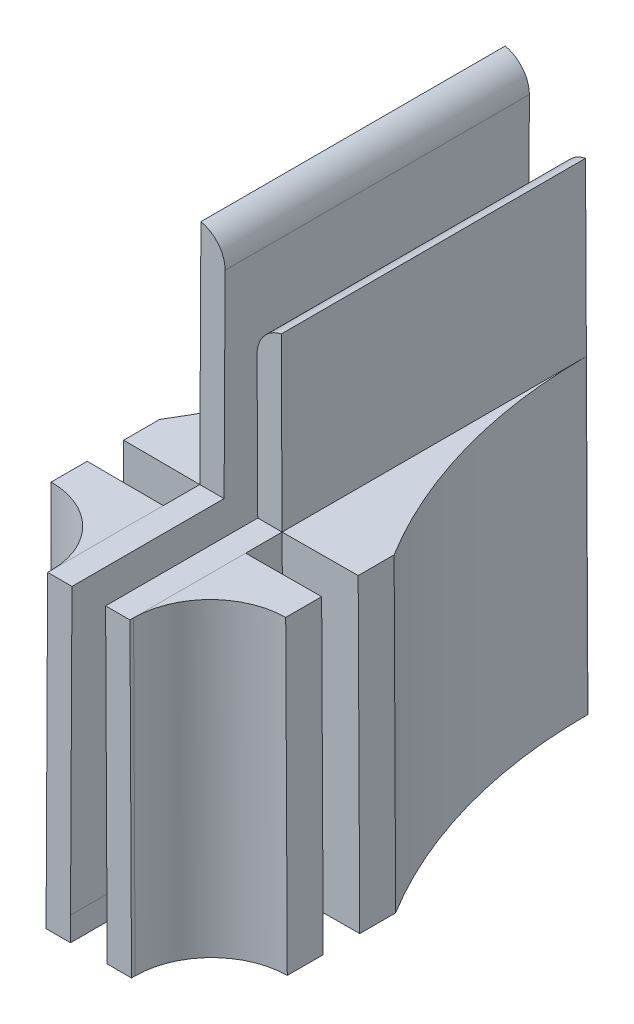
ISO-10303-21;
HEADER;
FILE_DESCRIPTION(('STEP AP214'),'2;1');
FILE_NAME('part.step','',(''),(''),'','','');
FILE_SCHEMA(('AUTOMOTIVE_DESIGN { 1 0 10303 214 1 1 1 1 }'));
ENDSEC;
DATA;
#1=APPLICATION_CONTEXT('core data for automotive mechanical design processes');
#2=APPLICATION_PROTOCOL_DEFINITION('international standard','automotive_design',2000,#1);
#3=PRODUCT_CONTEXT('',#1,'mechanical');
#4=PRODUCT('Part','Part','',(#3));
#5=PRODUCT_RELATED_PRODUCT_CATEGORY('part','',(#4));
#6=PRODUCT_DEFINITION_FORMATION('','',#4);
#7=PRODUCT_DEFINITION_CONTEXT('part definition',#1,'design');
#8=PRODUCT_DEFINITION('design','',#6,#7);
#9=PRODUCT_DEFINITION_SHAPE('','',#8);
#10=(LENGTH_UNIT() NAMED_UNIT(*) SI_UNIT(.MILLI.,.METRE.));
#11=(NAMED_UNIT(*) PLANE_ANGLE_UNIT() SI_UNIT($,.RADIAN.));
#12=(NAMED_UNIT(*) SI_UNIT($,.STERADIAN.) SOLID_ANGLE_UNIT());
#13=UNCERTAINTY_MEASURE_WITH_UNIT(LENGTH_MEASURE(1.E-05),#10,'distance_accuracy_value','');
#14=(GEOMETRIC_REPRESENTATION_CONTEXT(3) GLOBAL_UNCERTAINTY_ASSIGNED_CONTEXT((#13)) GLOBAL_UNIT_ASSIGNED_CONTEXT((#10,
#11,#12)) REPRESENTATION_CONTEXT('',''));
#15=CARTESIAN_POINT('',(0.,0.,0.));
#16=DIRECTION('',(0.,0.,1.));
#17=DIRECTION('',(1.,0.,0.));
#18=AXIS2_PLACEMENT_3D('',#15,#16,#17);
#19=CARTESIAN_POINT('',(-3.56593637484045,0.0178299047494033,38.1));
#20=DIRECTION('',(0.999987499921874,-0.00499999999999963,0.));
#21=DIRECTION('',(0.00499999999999963,0.999987499921874,0.));
#22=AXIS2_PLACEMENT_3D('',#19,#20,#21);
#23=PLANE('',#22);
#24=DIRECTION('',(0.,0.,-1.));
#25=VECTOR('',#24,1.);
#26=CARTESIAN_POINT('',(-3.56602552547859,0.,38.1));
#27=LINE('',#26,#25);
#28=CARTESIAN_POINT('',(-3.56602552547859,0.,0.039342585693096));
#29=VERTEX_POINT('',#28);
#30=CARTESIAN_POINT('',(-3.56602552547859,0.,0.));
#31=VERTEX_POINT('',#30);
#32=EDGE_CURVE('E517',#29,#31,#27,.T.);
#33=ORIENTED_EDGE('',*,*,#32,.F.);
#34=DIRECTION('',(0.00499999999999963,0.999987499921874,0.));
#35=VECTOR('',#34,1.);
#36=CARTESIAN_POINT('',(-3.56593637484045,0.0178299047494033,0.0393425856930821));
#37=LINE('',#36,#35);
#38=CARTESIAN_POINT('',(-3.43691329048857,25.8221242154014,0.0393425856930925));
#39=VERTEX_POINT('',#38);
#40=EDGE_CURVE('E242',#29,#39,#37,.T.);
#41=ORIENTED_EDGE('',*,*,#40,.T.);
#42=DIRECTION('',(0.,0.,-1.));
#43=VECTOR('',#42,1.);
#44=CARTESIAN_POINT('',(-3.43691329048857,25.8221242154014,22.4));
#45=LINE('',#44,#43);
#46=CARTESIAN_POINT('',(-3.43691329048857,25.8221242154014,25.4));
#47=VERTEX_POINT('',#46);
#48=EDGE_CURVE('E263',#47,#39,#45,.T.);
#49=ORIENTED_EDGE('',*,*,#48,.F.);
#50=DIRECTION('',(-0.00499999999999963,-0.999987499921874,0.));
#51=VECTOR('',#50,1.);
#52=CARTESIAN_POINT('',(-3.56593637484045,0.0178299047494033,25.4));
#53=LINE('',#52,#51);
#54=CARTESIAN_POINT('',(-3.3416620998412,44.8721242154013,25.4));
#55=VERTEX_POINT('',#54);
#56=EDGE_CURVE('E412',#55,#47,#53,.T.);
#57=ORIENTED_EDGE('',*,*,#56,.F.);
#58=DIRECTION('',(0.,0.,-1.));
#59=VECTOR('',#58,1.);
#60=CARTESIAN_POINT('',(-3.34166209984125,44.8721242154013,38.1));
#61=LINE('',#60,#59);
#62=CARTESIAN_POINT('',(-3.34166209984125,44.8721242154013,0.));
#63=VERTEX_POINT('',#62);
#64=EDGE_CURVE('E523',#55,#63,#61,.T.);
#65=ORIENTED_EDGE('',*,*,#64,.T.);
#66=DIRECTION('',(-0.00499999999999963,-0.999987499921874,0.));
#67=VECTOR('',#66,1.);
#68=CARTESIAN_POINT('',(-3.56593637484045,0.0178299047494033,0.));
#69=LINE('',#68,#67);
#70=EDGE_CURVE('E482',#63,#31,#69,.T.);
#71=ORIENTED_EDGE('',*,*,#70,.T.);
#72=EDGE_LOOP('',(#33,#41,#49,#57,#65,#71));
#73=FACE_BOUND('',#72,.T.);
#74=ADVANCED_FACE('F41',(#73),#23,.F.);
#75=DIRECTION('',(0.00499999999999963,0.999987499921874,0.));
#76=VECTOR('',#75,1.);
#77=CARTESIAN_POINT('',(-3.56602552547859,0.,25.4));
#78=LINE('',#77,#76);
#79=CARTESIAN_POINT('',(-3.56602552547859,0.,25.4));
#80=VERTEX_POINT('',#79);
#81=EDGE_CURVE('E266',#80,#47,#78,.T.);
#82=ORIENTED_EDGE('',*,*,#81,.F.);
#83=CARTESIAN_POINT('',(-3.56602552547859,0.,28.448));
#84=VERTEX_POINT('',#83);
#85=EDGE_CURVE('E524',#84,#80,#27,.T.);
#86=ORIENTED_EDGE('',*,*,#85,.F.);
#87=DIRECTION('',(-0.00499999999999963,-0.999987499921874,0.));
#88=VECTOR('',#87,1.);
#89=CARTESIAN_POINT('',(-3.56602552547859,0.,28.448));
#90=LINE('',#89,#88);
#91=CARTESIAN_POINT('',(-3.43691329048857,25.8221242154013,28.448));
#92=VERTEX_POINT('',#91);
#93=EDGE_CURVE('E302',#92,#84,#90,.T.);
#94=ORIENTED_EDGE('',*,*,#93,.F.);
#95=DIRECTION('',(0.,0.,1.));
#96=VECTOR('',#95,1.);
#97=CARTESIAN_POINT('',(-3.43691329048857,25.8221242154013,25.4));
#98=LINE('',#97,#96);
#99=EDGE_CURVE('E429',#47,#92,#98,.T.);
#100=ORIENTED_EDGE('',*,*,#99,.F.);
#101=EDGE_LOOP('',(#82,#86,#94,#100));
#102=FACE_BOUND('',#101,.T.);
#103=ADVANCED_FACE('F619',(#102),#23,.F.);
#104=CARTESIAN_POINT('',(-3.43691329048857,25.8221242154013,37.798));
#105=VERTEX_POINT('',#104);
#106=CARTESIAN_POINT('',(-3.43691329048857,25.8221242154013,38.1));
#107=VERTEX_POINT('',#106);
#108=EDGE_CURVE('E420',#105,#107,#98,.T.);
#109=ORIENTED_EDGE('',*,*,#108,.F.);
#110=DIRECTION('',(0.00499999999999963,0.999987499921874,0.));
#111=VECTOR('',#110,1.);
#112=CARTESIAN_POINT('',(-3.56602552547859,0.,37.798));
#113=LINE('',#112,#111);
#114=CARTESIAN_POINT('',(-3.56602552547859,0.,37.798));
#115=VERTEX_POINT('',#114);
#116=EDGE_CURVE('E563',#105,#115,#113,.F.);
#117=ORIENTED_EDGE('',*,*,#116,.T.);
#118=CARTESIAN_POINT('',(-3.56602552547859,0.,38.1));
#119=VERTEX_POINT('',#118);
#120=EDGE_CURVE('E519',#119,#115,#27,.T.);
#121=ORIENTED_EDGE('',*,*,#120,.F.);
#122=DIRECTION('',(-0.00499999999999963,-0.999987499921874,0.));
#123=VECTOR('',#122,1.);
#124=CARTESIAN_POINT('',(-3.56593637484045,0.0178299047494033,38.1));
#125=LINE('',#124,#123);
#126=EDGE_CURVE('E461',#107,#119,#125,.T.);
#127=ORIENTED_EDGE('',*,*,#126,.F.);
#128=EDGE_LOOP('',(#109,#117,#121,#127));
#129=FACE_BOUND('',#128,.T.);
#130=ADVANCED_FACE('F585',(#129),#23,.F.);
#131=CARTESIAN_POINT('',(3.56593637484045,0.0178299047494033,38.1));
#132=DIRECTION('',(-0.999987499921874,-0.00499999999999963,0.));
#133=DIRECTION('',(0.00499999999999963,-0.999987499921874,0.));
#134=AXIS2_PLACEMENT_3D('',#131,#132,#133);
#135=PLANE('',#134);
#136=DIRECTION('',(-0.00499999999999963,0.999987499921874,0.));
#137=VECTOR('',#136,1.);
#138=CARTESIAN_POINT('',(3.43691329048857,25.8221242154014,28.448));
#139=LINE('',#138,#137);
#140=CARTESIAN_POINT('',(3.56602552547859,0.,28.448));
#141=VERTEX_POINT('',#140);
#142=CARTESIAN_POINT('',(3.43691329048857,25.8221242154013,28.448));
#143=VERTEX_POINT('',#142);
#144=EDGE_CURVE('E316',#141,#143,#139,.T.);
#145=ORIENTED_EDGE('',*,*,#144,.F.);
#146=DIRECTION('',(0.,0.,-1.));
#147=VECTOR('',#146,1.);
#148=CARTESIAN_POINT('',(3.56602552547859,0.,38.1));
#149=LINE('',#148,#147);
#150=CARTESIAN_POINT('',(3.56602552547859,0.,25.4));
#151=VERTEX_POINT('',#150);
#152=EDGE_CURVE('E518',#141,#151,#149,.T.);
#153=ORIENTED_EDGE('',*,*,#152,.T.);
#154=DIRECTION('',(0.00499999999999963,-0.999987499921874,0.));
#155=VECTOR('',#154,1.);
#156=CARTESIAN_POINT('',(3.43691329048857,25.8221242154014,25.4));
#157=LINE('',#156,#155);
#158=CARTESIAN_POINT('',(3.43691329048857,25.8221242154013,25.4));
#159=VERTEX_POINT('',#158);
#160=EDGE_CURVE('E350',#159,#151,#157,.T.);
#161=ORIENTED_EDGE('',*,*,#160,.F.);
#162=DIRECTION('',(0.,0.,1.));
#163=VECTOR('',#162,1.);
#164=CARTESIAN_POINT('',(3.43691329048857,25.8221242154013,25.4));
#165=LINE('',#164,#163);
#166=EDGE_CURVE('E406',#159,#143,#165,.T.);
#167=ORIENTED_EDGE('',*,*,#166,.T.);
#168=EDGE_LOOP('',(#145,#153,#161,#167));
#169=FACE_BOUND('',#168,.T.);
#170=ADVANCED_FACE('F648',(#169),#135,.F.);
#171=CARTESIAN_POINT('',(3.56602552547859,0.,38.1));
#172=VERTEX_POINT('',#171);
#173=CARTESIAN_POINT('',(3.56602552547859,0.,37.798));
#174=VERTEX_POINT('',#173);
#175=EDGE_CURVE('E513',#172,#174,#149,.T.);
#176=ORIENTED_EDGE('',*,*,#175,.T.);
#177=DIRECTION('',(0.00499999999999963,-0.999987499921874,0.));
#178=VECTOR('',#177,1.);
#179=CARTESIAN_POINT('',(3.43691329048857,25.8221242154014,37.798));
#180=LINE('',#179,#178);
#181=CARTESIAN_POINT('',(3.43691329048857,25.8221242154014,37.798));
#182=VERTEX_POINT('',#181);
#183=EDGE_CURVE('E559',#174,#182,#180,.F.);
#184=ORIENTED_EDGE('',*,*,#183,.T.);
#185=CARTESIAN_POINT('',(3.43691329048857,25.8221242154013,38.1));
#186=VERTEX_POINT('',#185);
#187=EDGE_CURVE('E428',#182,#186,#165,.T.);
#188=ORIENTED_EDGE('',*,*,#187,.T.);
#189=DIRECTION('',(-0.00499999999999963,0.999987499921874,0.));
#190=VECTOR('',#189,1.);
#191=CARTESIAN_POINT('',(3.56593637484045,0.0178299047494033,38.1));
#192=LINE('',#191,#190);
#193=EDGE_CURVE('E470',#172,#186,#192,.T.);
#194=ORIENTED_EDGE('',*,*,#193,.F.);
#195=EDGE_LOOP('',(#176,#184,#188,#194));
#196=FACE_BOUND('',#195,.T.);
#197=ADVANCED_FACE('F654',(#196),#135,.F.);
#198=DIRECTION('',(0.,0.,1.));
#199=VECTOR('',#198,1.);
#200=CARTESIAN_POINT('',(3.43691329048857,25.8221242154014,25.4));
#201=LINE('',#200,#199);
#202=CARTESIAN_POINT('',(3.43691329048857,25.8221242154014,0.0393425856930821));
#203=VERTEX_POINT('',#202);
#204=EDGE_CURVE('E356',#203,#159,#201,.T.);
#205=ORIENTED_EDGE('',*,*,#204,.F.);
#206=DIRECTION('',(-0.00499999999999963,0.999987499921874,0.));
#207=VECTOR('',#206,1.);
#208=CARTESIAN_POINT('',(3.56593637484045,0.0178299047494033,0.0393425856930821));
#209=LINE('',#208,#207);
#210=CARTESIAN_POINT('',(3.56602552547859,0.,0.0393425856930821));
#211=VERTEX_POINT('',#210);
#212=EDGE_CURVE('E545',#203,#211,#209,.F.);
#213=ORIENTED_EDGE('',*,*,#212,.T.);
#214=CARTESIAN_POINT('',(3.56602552547859,0.,0.));
#215=VERTEX_POINT('',#214);
#216=EDGE_CURVE('E512',#211,#215,#149,.T.);
#217=ORIENTED_EDGE('',*,*,#216,.T.);
#218=DIRECTION('',(-0.00499999999999963,0.999987499921874,0.));
#219=VECTOR('',#218,1.);
#220=CARTESIAN_POINT('',(3.56593637484045,0.0178299047494033,0.));
#221=LINE('',#220,#219);
#222=CARTESIAN_POINT('',(3.36547459984125,40.1096837470234,0.));
#223=VERTEX_POINT('',#222);
#224=EDGE_CURVE('E490',#215,#223,#221,.T.);
#225=ORIENTED_EDGE('',*,*,#224,.T.);
#226=DIRECTION('',(0.,0.,-1.));
#227=VECTOR('',#226,1.);
#228=CARTESIAN_POINT('',(3.36547459984125,40.1096837470234,38.1));
#229=LINE('',#228,#227);
#230=CARTESIAN_POINT('',(3.36547459984125,40.1096837470234,25.4));
#231=VERTEX_POINT('',#230);
#232=EDGE_CURVE('E509',#231,#223,#229,.T.);
#233=ORIENTED_EDGE('',*,*,#232,.F.);
#234=DIRECTION('',(-0.00499999999999963,0.999987499921874,0.));
#235=VECTOR('',#234,1.);
#236=CARTESIAN_POINT('',(3.56593637484045,0.0178299047494033,25.4));
#237=LINE('',#236,#235);
#238=EDGE_CURVE('E445',#159,#231,#237,.T.);
#239=ORIENTED_EDGE('',*,*,#238,.F.);
#240=EDGE_LOOP('',(#205,#213,#217,#225,#233,#239));
#241=FACE_BOUND('',#240,.T.);
#242=ADVANCED_FACE('F657',(#241),#135,.F.);
#243=CARTESIAN_POINT('',(0.,2.,38.1));
#244=DIRECTION('',(0.,-1.,0.));
#245=DIRECTION('',(0.,0.,-1.));
#246=AXIS2_PLACEMENT_3D('',#243,#244,#245);
#247=PLANE('',#246);
#248=DIRECTION('',(-1.,0.,0.));
#249=VECTOR('',#248,1.);
#250=CARTESIAN_POINT('',(-1.524,2.,25.4));
#251=LINE('',#250,#249);
#252=CARTESIAN_POINT('',(1.524,2.,25.4));
#253=VERTEX_POINT('',#252);
#254=CARTESIAN_POINT('',(-1.524,2.,25.4));
#255=VERTEX_POINT('',#254);
#256=EDGE_CURVE('E398',#253,#255,#251,.T.);
#257=ORIENTED_EDGE('',*,*,#256,.F.);
#258=DIRECTION('',(0.,0.,-1.));
#259=VECTOR('',#258,1.);
#260=CARTESIAN_POINT('',(1.524,2.,38.1));
#261=LINE('',#260,#259);
#262=CARTESIAN_POINT('',(1.524,2.,0.));
#263=VERTEX_POINT('',#262);
#264=EDGE_CURVE('E505',#253,#263,#261,.T.);
#265=ORIENTED_EDGE('',*,*,#264,.T.);
#266=DIRECTION('',(-1.,0.,0.));
#267=VECTOR('',#266,1.);
#268=CARTESIAN_POINT('',(0.,2.,0.));
#269=LINE('',#268,#267);
#270=CARTESIAN_POINT('',(-1.524,2.,0.));
#271=VERTEX_POINT('',#270);
#272=EDGE_CURVE('E462',#263,#271,#269,.T.);
#273=ORIENTED_EDGE('',*,*,#272,.T.);
#274=DIRECTION('',(0.,0.,-1.));
#275=VECTOR('',#274,1.);
#276=CARTESIAN_POINT('',(-1.524,2.,38.1));
#277=LINE('',#276,#275);
#278=EDGE_CURVE('E478',#255,#271,#277,.T.);
#279=ORIENTED_EDGE('',*,*,#278,.F.);
#280=EDGE_LOOP('',(#257,#265,#273,#279));
#281=FACE_BOUND('',#280,.T.);
#282=ADVANCED_FACE('F664',(#281),#247,.F.);
#283=CARTESIAN_POINT('',(0.,0.,38.1));
#284=DIRECTION('',(0.,0.,1.));
#285=DIRECTION('',(1.,0.,0.));
#286=AXIS2_PLACEMENT_3D('',#283,#284,#285);
#287=PLANE('',#286);
#288=DIRECTION('',(0.,-1.,0.));
#289=VECTOR('',#288,1.);
#290=CARTESIAN_POINT('',(-1.524,2.,38.1));
#291=LINE('',#290,#289);
#292=CARTESIAN_POINT('',(-1.524,2.,38.1));
#293=VERTEX_POINT('',#292);
#294=CARTESIAN_POINT('',(-1.524,0.,38.1));
#295=VERTEX_POINT('',#294);
#296=EDGE_CURVE('E403',#293,#295,#291,.T.);
#297=ORIENTED_EDGE('',*,*,#296,.F.);
#298=DIRECTION('',(0.005,0.999987499921874,0.));
#299=VECTOR('',#298,1.);
#300=CARTESIAN_POINT('',(-1.53396177499922,0.00766990474940469,38.1));
#301=LINE('',#300,#299);
#302=CARTESIAN_POINT('',(-1.40488789001231,25.8221242154013,38.1));
#303=VERTEX_POINT('',#302);
#304=EDGE_CURVE('E457',#293,#303,#301,.T.);
#305=ORIENTED_EDGE('',*,*,#304,.T.);
#306=DIRECTION('',(1.,0.,0.));
#307=VECTOR('',#306,1.);
#308=CARTESIAN_POINT('',(3.43691329048857,25.8221242154013,38.1));
#309=LINE('',#308,#307);
#310=EDGE_CURVE('E422',#107,#303,#309,.T.);
#311=ORIENTED_EDGE('',*,*,#310,.F.);
#312=ORIENTED_EDGE('',*,*,#126,.T.);
#313=DIRECTION('',(1.,0.,0.));
#314=VECTOR('',#313,1.);
#315=CARTESIAN_POINT('',(0.,0.,38.1));
#316=LINE('',#315,#314);
#317=EDGE_CURVE('E466',#119,#295,#316,.T.);
#318=ORIENTED_EDGE('',*,*,#317,.T.);
#319=EDGE_LOOP('',(#297,#305,#311,#312,#318));
#320=FACE_BOUND('',#319,.T.);
#321=ADVANCED_FACE('F595',(#320),#287,.T.);
#322=CARTESIAN_POINT('',(3.8859116576949,37.6235732770699,38.1));
#323=DIRECTION('',(0.,0.,-1.));
#324=DIRECTION('',(-1.,0.,0.));
#325=AXIS2_PLACEMENT_3D('',#322,#323,#324);
#326=CYLINDRICAL_SURFACE('',#325,2.54);
#327=DIRECTION('',(0.,0.,-1.));
#328=VECTOR('',#327,1.);
#329=CARTESIAN_POINT('',(1.34594340789334,37.6108732770699,38.1));
#330=LINE('',#329,#328);
#331=CARTESIAN_POINT('',(1.34594340789334,37.6108732770699,25.4));
#332=VERTEX_POINT('',#331);
#333=CARTESIAN_POINT('',(1.34594340789334,37.6108732770699,0.));
#334=VERTEX_POINT('',#333);
#335=EDGE_CURVE('E527',#332,#334,#330,.T.);
#336=ORIENTED_EDGE('',*,*,#335,.F.);
#337=CARTESIAN_POINT('',(3.8859116576949,37.6235732770699,25.4));
#338=DIRECTION('',(0.,0.,1.));
#339=DIRECTION('',(1.,0.,0.));
#340=AXIS2_PLACEMENT_3D('',#337,#338,#339);
#341=CIRCLE('',#340,2.54);
#342=EDGE_CURVE('E438',#332,#231,#341,.F.);
#343=ORIENTED_EDGE('',*,*,#342,.T.);
#344=ORIENTED_EDGE('',*,*,#232,.T.);
#345=CARTESIAN_POINT('',(3.8859116576949,37.6235732770699,0.));
#346=DIRECTION('',(0.,0.,1.));
#347=DIRECTION('',(1.,0.,0.));
#348=AXIS2_PLACEMENT_3D('',#345,#346,#347);
#349=CIRCLE('',#348,2.54);
#350=EDGE_CURVE('E533',#334,#223,#349,.F.);
#351=ORIENTED_EDGE('',*,*,#350,.F.);
#352=EDGE_LOOP('',(#336,#343,#344,#351));
#353=FACE_BOUND('',#352,.T.);
#354=ADVANCED_FACE('F734',(#353),#326,.T.);
#355=CARTESIAN_POINT('',(-3.8620991576949,42.3860137454478,38.1));
#356=DIRECTION('',(0.,0.,-1.));
#357=DIRECTION('',(-1.,0.,0.));
#358=AXIS2_PLACEMENT_3D('',#355,#356,#357);
#359=CYLINDRICAL_SURFACE('',#358,2.54);
#360=ORIENTED_EDGE('',*,*,#64,.F.);
#361=CARTESIAN_POINT('',(-3.8620991576949,42.3860137454478,25.4));
#362=DIRECTION('',(0.,0.,1.));
#363=DIRECTION('',(1.,0.,0.));
#364=AXIS2_PLACEMENT_3D('',#361,#362,#363);
#365=CIRCLE('',#364,2.54);
#366=CARTESIAN_POINT('',(-1.32213090789334,42.3733137454478,25.4));
#367=VERTEX_POINT('',#366);
#368=EDGE_CURVE('E541',#55,#367,#365,.F.);
#369=ORIENTED_EDGE('',*,*,#368,.T.);
#370=DIRECTION('',(0.,0.,-1.));
#371=VECTOR('',#370,1.);
#372=CARTESIAN_POINT('',(-1.32213090789334,42.3733137454478,38.1));
#373=LINE('',#372,#371);
#374=CARTESIAN_POINT('',(-1.32213090789334,42.3733137454478,0.));
#375=VERTEX_POINT('',#374);
#376=EDGE_CURVE('E537',#375,#367,#373,.F.);
#377=ORIENTED_EDGE('',*,*,#376,.F.);
#378=CARTESIAN_POINT('',(-3.8620991576949,42.3860137454478,0.));
#379=DIRECTION('',(0.,0.,1.));
#380=DIRECTION('',(1.,0.,0.));
#381=AXIS2_PLACEMENT_3D('',#378,#379,#380);
#382=CIRCLE('',#381,2.54);
#383=EDGE_CURVE('E530',#63,#375,#382,.F.);
#384=ORIENTED_EDGE('',*,*,#383,.F.);
#385=EDGE_LOOP('',(#360,#369,#377,#384));
#386=FACE_BOUND('',#385,.T.);
#387=ADVANCED_FACE('F609',(#386),#359,.T.);
#388=CARTESIAN_POINT('',(-1.53396177499922,0.00766990474940469,38.1));
#389=DIRECTION('',(-0.999987499921874,0.005,0.));
#390=DIRECTION('',(-0.005,-0.999987499921874,0.));
#391=AXIS2_PLACEMENT_3D('',#388,#389,#390);
#392=PLANE('',#391);
#393=DIRECTION('',(0.005,0.999987499921874,0.));
#394=VECTOR('',#393,1.);
#395=CARTESIAN_POINT('',(-1.53396177499922,0.00766990474940469,25.4));
#396=LINE('',#395,#394);
#397=CARTESIAN_POINT('',(-1.40488789001231,25.8221242154013,25.4));
#398=VERTEX_POINT('',#397);
#399=EDGE_CURVE('E435',#398,#367,#396,.T.);
#400=ORIENTED_EDGE('',*,*,#399,.F.);
#401=DIRECTION('',(0.,0.,1.));
#402=VECTOR('',#401,1.);
#403=CARTESIAN_POINT('',(-1.40488789001231,25.8221242154013,38.1));
#404=LINE('',#403,#402);
#405=EDGE_CURVE('E452',#398,#303,#404,.T.);
#406=ORIENTED_EDGE('',*,*,#405,.T.);
#407=ORIENTED_EDGE('',*,*,#304,.F.);
#408=EDGE_CURVE('E501',#293,#255,#277,.T.);
#409=ORIENTED_EDGE('',*,*,#408,.T.);
#410=ORIENTED_EDGE('',*,*,#278,.T.);
#411=DIRECTION('',(0.005,0.999987499921874,0.));
#412=VECTOR('',#411,1.);
#413=CARTESIAN_POINT('',(-1.53396177499922,0.00766990474940469,0.));
#414=LINE('',#413,#412);
#415=EDGE_CURVE('E456',#271,#375,#414,.T.);
#416=ORIENTED_EDGE('',*,*,#415,.T.);
#417=ORIENTED_EDGE('',*,*,#376,.T.);
#418=EDGE_LOOP('',(#400,#406,#407,#409,#410,#416,#417));
#419=FACE_BOUND('',#418,.T.);
#420=ADVANCED_FACE('F602',(#419),#392,.F.);
#421=CARTESIAN_POINT('',(0.,0.,38.1));
#422=DIRECTION('',(0.,1.,0.));
#423=DIRECTION('',(-1.,0.,0.));
#424=AXIS2_PLACEMENT_3D('',#421,#422,#423);
#425=PLANE('',#424);
#426=DIRECTION('',(1.,0.,0.));
#427=VECTOR('',#426,1.);
#428=CARTESIAN_POINT('',(-1.524,0.,25.4));
#429=LINE('',#428,#427);
#430=CARTESIAN_POINT('',(-1.524,0.,25.4));
#431=VERTEX_POINT('',#430);
#432=CARTESIAN_POINT('',(1.524,0.,25.4));
#433=VERTEX_POINT('',#432);
#434=EDGE_CURVE('E389',#431,#433,#429,.T.);
#435=ORIENTED_EDGE('',*,*,#434,.F.);
#436=DIRECTION('',(0.,0.,1.));
#437=VECTOR('',#436,1.);
#438=CARTESIAN_POINT('',(-1.524,0.,25.4));
#439=LINE('',#438,#437);
#440=EDGE_CURVE('E402',#431,#295,#439,.T.);
#441=ORIENTED_EDGE('',*,*,#440,.T.);
#442=ORIENTED_EDGE('',*,*,#317,.F.);
#443=ORIENTED_EDGE('',*,*,#120,.T.);
#444=DIRECTION('',(0.,0.,1.));
#445=VECTOR('',#444,1.);
#446=CARTESIAN_POINT('',(-3.56602552547859,0.,31.448));
#447=LINE('',#446,#445);
#448=EDGE_CURVE('E289',#84,#115,#447,.T.);
#449=ORIENTED_EDGE('',*,*,#448,.F.);
#450=ORIENTED_EDGE('',*,*,#85,.T.);
#451=DIRECTION('',(0.,0.,1.));
#452=VECTOR('',#451,1.);
#453=CARTESIAN_POINT('',(-3.56602552547859,0.,22.4));
#454=LINE('',#453,#452);
#455=EDGE_CURVE('E274',#29,#80,#454,.T.);
#456=ORIENTED_EDGE('',*,*,#455,.F.);
#457=ORIENTED_EDGE('',*,*,#32,.T.);
#458=DIRECTION('',(1.,0.,0.));
#459=VECTOR('',#458,1.);
#460=CARTESIAN_POINT('',(0.,0.,0.));
#461=LINE('',#460,#459);
#462=EDGE_CURVE('E486',#31,#215,#461,.T.);
#463=ORIENTED_EDGE('',*,*,#462,.T.);
#464=ORIENTED_EDGE('',*,*,#216,.F.);
#465=DIRECTION('',(0.,0.,-1.));
#466=VECTOR('',#465,1.);
#467=CARTESIAN_POINT('',(3.56602552547859,0.,25.4));
#468=LINE('',#467,#466);
#469=EDGE_CURVE('E371',#151,#211,#468,.T.);
#470=ORIENTED_EDGE('',*,*,#469,.F.);
#471=ORIENTED_EDGE('',*,*,#152,.F.);
#472=DIRECTION('',(0.,0.,-1.));
#473=VECTOR('',#472,1.);
#474=CARTESIAN_POINT('',(3.56602552547859,0.,28.448));
#475=LINE('',#474,#473);
#476=EDGE_CURVE('E322',#174,#141,#475,.T.);
#477=ORIENTED_EDGE('',*,*,#476,.F.);
#478=ORIENTED_EDGE('',*,*,#175,.F.);
#479=CARTESIAN_POINT('',(1.524,0.,38.1));
#480=VERTEX_POINT('',#479);
#481=EDGE_CURVE('E465',#480,#172,#316,.T.);
#482=ORIENTED_EDGE('',*,*,#481,.F.);
#483=DIRECTION('',(0.,0.,1.));
#484=VECTOR('',#483,1.);
#485=CARTESIAN_POINT('',(1.524,0.,25.4));
#486=LINE('',#485,#484);
#487=EDGE_CURVE('E409',#433,#480,#486,.T.);
#488=ORIENTED_EDGE('',*,*,#487,.F.);
#489=EDGE_LOOP('',(#435,#441,#442,#443,#449,#450,#456,#457,#463,#464,#470,#471,#477,#478,#482,#488));
#490=FACE_BOUND('',#489,.T.);
#491=ADVANCED_FACE('F590',(#490),#425,.F.);
#492=CARTESIAN_POINT('',(1.53396177499922,0.00766990474940469,38.1));
#493=DIRECTION('',(0.999987499921874,0.005,0.));
#494=DIRECTION('',(-0.005,0.999987499921874,0.));
#495=AXIS2_PLACEMENT_3D('',#492,#493,#494);
#496=PLANE('',#495);
#497=DIRECTION('',(0.005,-0.999987499921874,0.));
#498=VECTOR('',#497,1.);
#499=CARTESIAN_POINT('',(1.53396177499922,0.00766990474940469,38.1));
#500=LINE('',#499,#498);
#501=CARTESIAN_POINT('',(1.40488789001231,25.8221242154013,38.1));
#502=VERTEX_POINT('',#501);
#503=CARTESIAN_POINT('',(1.524,2.,38.1));
#504=VERTEX_POINT('',#503);
#505=EDGE_CURVE('E474',#502,#504,#500,.T.);
#506=ORIENTED_EDGE('',*,*,#505,.F.);
#507=DIRECTION('',(0.,0.,-1.));
#508=VECTOR('',#507,1.);
#509=CARTESIAN_POINT('',(1.40488789001231,25.8221242154013,38.1));
#510=LINE('',#509,#508);
#511=CARTESIAN_POINT('',(1.40488789001231,25.8221242154013,25.4));
#512=VERTEX_POINT('',#511);
#513=EDGE_CURVE('E448',#502,#512,#510,.T.);
#514=ORIENTED_EDGE('',*,*,#513,.T.);
#515=DIRECTION('',(0.005,-0.999987499921874,0.));
#516=VECTOR('',#515,1.);
#517=CARTESIAN_POINT('',(1.53396177499922,0.00766990474940469,25.4));
#518=LINE('',#517,#516);
#519=EDGE_CURVE('E442',#332,#512,#518,.T.);
#520=ORIENTED_EDGE('',*,*,#519,.F.);
#521=ORIENTED_EDGE('',*,*,#335,.T.);
#522=DIRECTION('',(0.005,-0.999987499921874,0.));
#523=VECTOR('',#522,1.);
#524=CARTESIAN_POINT('',(1.53396177499922,0.00766990474940469,0.));
#525=LINE('',#524,#523);
#526=EDGE_CURVE('E494',#334,#263,#525,.T.);
#527=ORIENTED_EDGE('',*,*,#526,.T.);
#528=ORIENTED_EDGE('',*,*,#264,.F.);
#529=EDGE_CURVE('E506',#504,#253,#261,.T.);
#530=ORIENTED_EDGE('',*,*,#529,.F.);
#531=EDGE_LOOP('',(#506,#514,#520,#521,#527,#528,#530));
#532=FACE_BOUND('',#531,.T.);
#533=ADVANCED_FACE('F737',(#532),#496,.F.);
#534=DIRECTION('',(0.,1.,0.));
#535=VECTOR('',#534,1.);
#536=CARTESIAN_POINT('',(1.524,2.,38.1));
#537=LINE('',#536,#535);
#538=EDGE_CURVE('E390',#480,#504,#537,.T.);
#539=ORIENTED_EDGE('',*,*,#538,.F.);
#540=ORIENTED_EDGE('',*,*,#481,.T.);
#541=ORIENTED_EDGE('',*,*,#193,.T.);
#542=EDGE_CURVE('E384',#502,#186,#309,.T.);
#543=ORIENTED_EDGE('',*,*,#542,.F.);
#544=ORIENTED_EDGE('',*,*,#505,.T.);
#545=EDGE_LOOP('',(#539,#540,#541,#543,#544));
#546=FACE_BOUND('',#545,.T.);
#547=ADVANCED_FACE('F742',(#546),#287,.T.);
#548=CARTESIAN_POINT('',(0.,0.,0.));
#549=DIRECTION('',(0.,0.,1.));
#550=DIRECTION('',(1.,0.,0.));
#551=AXIS2_PLACEMENT_3D('',#548,#549,#550);
#552=PLANE('',#551);
#553=ORIENTED_EDGE('',*,*,#526,.F.);
#554=ORIENTED_EDGE('',*,*,#350,.T.);
#555=ORIENTED_EDGE('',*,*,#224,.F.);
#556=ORIENTED_EDGE('',*,*,#462,.F.);
#557=ORIENTED_EDGE('',*,*,#70,.F.);
#558=ORIENTED_EDGE('',*,*,#383,.T.);
#559=ORIENTED_EDGE('',*,*,#415,.F.);
#560=ORIENTED_EDGE('',*,*,#272,.F.);
#561=EDGE_LOOP('',(#553,#554,#555,#556,#557,#558,#559,#560));
#562=FACE_BOUND('',#561,.T.);
#563=ADVANCED_FACE('F729',(#562),#552,.F.);
#564=CARTESIAN_POINT('',(0.,0.,25.4));
#565=DIRECTION('',(0.,0.,1.));
#566=DIRECTION('',(1.,0.,0.));
#567=AXIS2_PLACEMENT_3D('',#564,#565,#566);
#568=PLANE('',#567);
#569=ORIENTED_EDGE('',*,*,#399,.T.);
#570=ORIENTED_EDGE('',*,*,#368,.F.);
#571=ORIENTED_EDGE('',*,*,#56,.T.);
#572=DIRECTION('',(1.,0.,0.));
#573=VECTOR('',#572,1.);
#574=CARTESIAN_POINT('',(3.43691329048857,25.8221242154013,25.4));
#575=LINE('',#574,#573);
#576=EDGE_CURVE('E416',#47,#398,#575,.T.);
#577=ORIENTED_EDGE('',*,*,#576,.T.);
#578=EDGE_LOOP('',(#569,#570,#571,#577));
#579=FACE_BOUND('',#578,.T.);
#580=ADVANCED_FACE('F605',(#579),#568,.T.);
#581=CARTESIAN_POINT('',(3.43691329048857,25.8221242154013,25.4));
#582=DIRECTION('',(0.,-1.,0.));
#583=DIRECTION('',(0.,0.,-1.));
#584=AXIS2_PLACEMENT_3D('',#581,#582,#583);
#585=PLANE('',#584);
#586=ORIENTED_EDGE('',*,*,#576,.F.);
#587=ORIENTED_EDGE('',*,*,#99,.T.);
#588=DIRECTION('',(0.,0.,-1.));
#589=VECTOR('',#588,1.);
#590=CARTESIAN_POINT('',(-3.43691329048857,25.8221242154014,31.448));
#591=LINE('',#590,#589);
#592=EDGE_CURVE('E58',#105,#92,#591,.T.);
#593=ORIENTED_EDGE('',*,*,#592,.F.);
#594=ORIENTED_EDGE('',*,*,#108,.T.);
#595=ORIENTED_EDGE('',*,*,#310,.T.);
#596=ORIENTED_EDGE('',*,*,#405,.F.);
#597=EDGE_LOOP('',(#586,#587,#593,#594,#595,#596));
#598=FACE_BOUND('',#597,.T.);
#599=ADVANCED_FACE('F599',(#598),#585,.F.);
#600=ORIENTED_EDGE('',*,*,#542,.T.);
#601=ORIENTED_EDGE('',*,*,#187,.F.);
#602=DIRECTION('',(0.,0.,1.));
#603=VECTOR('',#602,1.);
#604=CARTESIAN_POINT('',(3.43691329048857,25.8221242154014,28.448));
#605=LINE('',#604,#603);
#606=EDGE_CURVE('E337',#143,#182,#605,.T.);
#607=ORIENTED_EDGE('',*,*,#606,.F.);
#608=ORIENTED_EDGE('',*,*,#166,.F.);
#609=EDGE_CURVE('E421',#512,#159,#575,.T.);
#610=ORIENTED_EDGE('',*,*,#609,.F.);
#611=ORIENTED_EDGE('',*,*,#513,.F.);
#612=EDGE_LOOP('',(#600,#601,#607,#608,#610,#611));
#613=FACE_BOUND('',#612,.T.);
#614=ADVANCED_FACE('F703',(#613),#585,.F.);
#615=ORIENTED_EDGE('',*,*,#238,.T.);
#616=ORIENTED_EDGE('',*,*,#342,.F.);
#617=ORIENTED_EDGE('',*,*,#519,.T.);
#618=ORIENTED_EDGE('',*,*,#609,.T.);
#619=EDGE_LOOP('',(#615,#616,#617,#618));
#620=FACE_BOUND('',#619,.T.);
#621=ADVANCED_FACE('F698',(#620),#568,.T.);
#622=CARTESIAN_POINT('',(-1.524,2.,25.4));
#623=DIRECTION('',(-1.,0.,0.));
#624=DIRECTION('',(0.,0.,1.));
#625=AXIS2_PLACEMENT_3D('',#622,#623,#624);
#626=PLANE('',#625);
#627=ORIENTED_EDGE('',*,*,#296,.T.);
#628=ORIENTED_EDGE('',*,*,#440,.F.);
#629=DIRECTION('',(0.,-1.,0.));
#630=VECTOR('',#629,1.);
#631=CARTESIAN_POINT('',(-1.524,2.,25.4));
#632=LINE('',#631,#630);
#633=EDGE_CURVE('E385',#255,#431,#632,.T.);
#634=ORIENTED_EDGE('',*,*,#633,.F.);
#635=ORIENTED_EDGE('',*,*,#408,.F.);
#636=EDGE_LOOP('',(#627,#628,#634,#635));
#637=FACE_BOUND('',#636,.T.);
#638=ADVANCED_FACE('F754',(#637),#626,.F.);
#639=CARTESIAN_POINT('',(1.524,2.,25.4));
#640=DIRECTION('',(1.,0.,0.));
#641=DIRECTION('',(0.,1.,0.));
#642=AXIS2_PLACEMENT_3D('',#639,#640,#641);
#643=PLANE('',#642);
#644=ORIENTED_EDGE('',*,*,#538,.T.);
#645=ORIENTED_EDGE('',*,*,#529,.T.);
#646=DIRECTION('',(0.,1.,0.));
#647=VECTOR('',#646,1.);
#648=CARTESIAN_POINT('',(1.524,2.,25.4));
#649=LINE('',#648,#647);
#650=EDGE_CURVE('E394',#433,#253,#649,.T.);
#651=ORIENTED_EDGE('',*,*,#650,.F.);
#652=ORIENTED_EDGE('',*,*,#487,.T.);
#653=EDGE_LOOP('',(#644,#645,#651,#652));
#654=FACE_BOUND('',#653,.T.);
#655=ADVANCED_FACE('F759',(#654),#643,.F.);
#656=CARTESIAN_POINT('',(0.,0.,25.4));
#657=DIRECTION('',(0.,0.,1.));
#658=DIRECTION('',(1.,0.,0.));
#659=AXIS2_PLACEMENT_3D('',#656,#657,#658);
#660=PLANE('',#659);
#661=ORIENTED_EDGE('',*,*,#633,.T.);
#662=ORIENTED_EDGE('',*,*,#434,.T.);
#663=ORIENTED_EDGE('',*,*,#650,.T.);
#664=ORIENTED_EDGE('',*,*,#256,.T.);
#665=EDGE_LOOP('',(#661,#662,#663,#664));
#666=FACE_BOUND('',#665,.T.);
#667=ADVANCED_FACE('F756',(#666),#660,.T.);
#668=CARTESIAN_POINT('',(9.78683391499247,25.8538742154013,25.4));
#669=DIRECTION('',(0.,0.,-1.));
#670=DIRECTION('',(-1.,0.,0.));
#671=AXIS2_PLACEMENT_3D('',#668,#669,#670);
#672=PLANE('',#671);
#673=ORIENTED_EDGE('',*,*,#160,.T.);
#674=DIRECTION('',(-0.999987499921874,-0.00499999999999963,0.));
#675=VECTOR('',#674,1.);
#676=CARTESIAN_POINT('',(9.91594614998249,0.0317499999999981,25.4));
#677=LINE('',#676,#675);
#678=CARTESIAN_POINT('',(9.91594614998249,0.0317499999999981,25.4));
#679=VERTEX_POINT('',#678);
#680=EDGE_CURVE('E380',#679,#151,#677,.T.);
#681=ORIENTED_EDGE('',*,*,#680,.F.);
#682=DIRECTION('',(0.00499999999999963,-0.999987499921874,0.));
#683=VECTOR('',#682,1.);
#684=CARTESIAN_POINT('',(9.78683391499247,25.8538742154013,25.4));
#685=LINE('',#684,#683);
#686=CARTESIAN_POINT('',(9.78683391499247,25.8538742154013,25.4));
#687=VERTEX_POINT('',#686);
#688=EDGE_CURVE('E351',#687,#679,#685,.T.);
#689=ORIENTED_EDGE('',*,*,#688,.F.);
#690=DIRECTION('',(-0.999987499921874,-0.00499999999999963,0.));
#691=VECTOR('',#690,1.);
#692=CARTESIAN_POINT('',(9.78683391499247,25.8538742154013,25.4));
#693=LINE('',#692,#691);
#694=EDGE_CURVE('E367',#687,#159,#693,.T.);
#695=ORIENTED_EDGE('',*,*,#694,.T.);
#696=EDGE_LOOP('',(#673,#681,#689,#695));
#697=FACE_BOUND('',#696,.T.);
#698=ADVANCED_FACE('F692',(#697),#672,.F.);
#699=CARTESIAN_POINT('',(9.91594614998249,0.0317499999999981,25.4));
#700=DIRECTION('',(-0.00499999999999963,0.999987499921874,0.));
#701=DIRECTION('',(-0.999987499921874,-0.00499999999999963,0.));
#702=AXIS2_PLACEMENT_3D('',#699,#700,#701);
#703=PLANE('',#702);
#704=ORIENTED_EDGE('',*,*,#469,.T.);
#705=CARTESIAN_POINT('',(46.1104937096547,0.21272499999998,0.0393425856930821));
#706=DIRECTION('',(-0.00499999999999963,0.999987499921874,0.));
#707=DIRECTION('',(-0.999987499921874,-0.00499999999999963,0.));
#708=AXIS2_PLACEMENT_3D('',#705,#706,#707);
#709=CIRCLE('',#708,42.545);
#710=CARTESIAN_POINT('',(9.91594614998249,0.0317499999999981,22.4));
#711=VERTEX_POINT('',#710);
#712=EDGE_CURVE('E246',#211,#711,#709,.T.);
#713=ORIENTED_EDGE('',*,*,#712,.T.);
#714=DIRECTION('',(0.,0.,-1.));
#715=VECTOR('',#714,1.);
#716=CARTESIAN_POINT('',(9.91594614998249,0.0317499999999981,25.4));
#717=LINE('',#716,#715);
#718=EDGE_CURVE('E355',#679,#711,#717,.T.);
#719=ORIENTED_EDGE('',*,*,#718,.F.);
#720=ORIENTED_EDGE('',*,*,#680,.T.);
#721=EDGE_LOOP('',(#704,#713,#719,#720));
#722=FACE_BOUND('',#721,.T.);
#723=ADVANCED_FACE('F685',(#722),#703,.F.);
#724=CARTESIAN_POINT('',(9.78683391499247,25.8538742154013,25.4));
#725=DIRECTION('',(0.00499999999999963,-0.999987499921874,0.));
#726=DIRECTION('',(0.999987499921874,0.00499999999999963,0.));
#727=AXIS2_PLACEMENT_3D('',#724,#725,#726);
#728=PLANE('',#727);
#729=ORIENTED_EDGE('',*,*,#204,.T.);
#730=ORIENTED_EDGE('',*,*,#694,.F.);
#731=DIRECTION('',(0.,0.,1.));
#732=VECTOR('',#731,1.);
#733=CARTESIAN_POINT('',(9.78683391499247,25.8538742154013,25.4));
#734=LINE('',#733,#732);
#735=CARTESIAN_POINT('',(9.78683391499247,25.8538742154013,22.4));
#736=VERTEX_POINT('',#735);
#737=EDGE_CURVE('E364',#736,#687,#734,.T.);
#738=ORIENTED_EDGE('',*,*,#737,.F.);
#739=CARTESIAN_POINT('',(45.9813814746647,26.0348492154013,0.0393425856930821));
#740=DIRECTION('',(0.00499999999999963,-0.999987499921874,0.));
#741=DIRECTION('',(0.999987499921874,0.00499999999999963,0.));
#742=AXIS2_PLACEMENT_3D('',#739,#740,#741);
#743=CIRCLE('',#742,42.545);
#744=EDGE_CURVE('E551',#736,#203,#743,.T.);
#745=ORIENTED_EDGE('',*,*,#744,.T.);
#746=EDGE_LOOP('',(#729,#730,#738,#745));
#747=FACE_BOUND('',#746,.T.);
#748=ADVANCED_FACE('F679',(#747),#728,.F.);
#749=CARTESIAN_POINT('',(9.91585699934436,0.049579904749401,0.));
#750=DIRECTION('',(0.999987499921874,0.00499999999999963,0.));
#751=DIRECTION('',(-0.00499999999999963,0.999987499921874,0.));
#752=AXIS2_PLACEMENT_3D('',#749,#750,#751);
#753=PLANE('',#752);
#754=ORIENTED_EDGE('',*,*,#688,.T.);
#755=ORIENTED_EDGE('',*,*,#718,.T.);
#756=DIRECTION('',(-0.00499999999999963,0.999987499921874,0.));
#757=VECTOR('',#756,1.);
#758=CARTESIAN_POINT('',(9.78683391499247,25.8538742154013,22.4));
#759=LINE('',#758,#757);
#760=EDGE_CURVE('E360',#711,#736,#759,.T.);
#761=ORIENTED_EDGE('',*,*,#760,.T.);
#762=ORIENTED_EDGE('',*,*,#737,.T.);
#763=EDGE_LOOP('',(#754,#755,#761,#762));
#764=FACE_BOUND('',#763,.T.);
#765=ADVANCED_FACE('F688',(#764),#753,.T.);
#766=CARTESIAN_POINT('',(9.78683391499247,25.8538742154013,28.448));
#767=DIRECTION('',(0.,0.,1.));
#768=DIRECTION('',(1.,0.,0.));
#769=AXIS2_PLACEMENT_3D('',#766,#767,#768);
#770=PLANE('',#769);
#771=ORIENTED_EDGE('',*,*,#144,.T.);
#772=DIRECTION('',(-0.999987499921874,-0.00499999999999963,0.));
#773=VECTOR('',#772,1.);
#774=CARTESIAN_POINT('',(9.78683391499247,25.8538742154013,28.448));
#775=LINE('',#774,#773);
#776=CARTESIAN_POINT('',(9.78683391499247,25.8538742154013,28.448));
#777=VERTEX_POINT('',#776);
#778=EDGE_CURVE('E346',#777,#143,#775,.T.);
#779=ORIENTED_EDGE('',*,*,#778,.F.);
#780=DIRECTION('',(-0.00499999999999963,0.999987499921874,0.));
#781=VECTOR('',#780,1.);
#782=CARTESIAN_POINT('',(9.78683391499247,25.8538742154013,28.448));
#783=LINE('',#782,#781);
#784=CARTESIAN_POINT('',(9.91594614998249,0.0317499999999981,28.448));
#785=VERTEX_POINT('',#784);
#786=EDGE_CURVE('E317',#785,#777,#783,.T.);
#787=ORIENTED_EDGE('',*,*,#786,.F.);
#788=DIRECTION('',(-0.999987499921874,-0.00499999999999963,0.));
#789=VECTOR('',#788,1.);
#790=CARTESIAN_POINT('',(9.91594614998249,0.0317499999999981,28.448));
#791=LINE('',#790,#789);
#792=EDGE_CURVE('E333',#785,#141,#791,.T.);
#793=ORIENTED_EDGE('',*,*,#792,.T.);
#794=EDGE_LOOP('',(#771,#779,#787,#793));
#795=FACE_BOUND('',#794,.T.);
#796=ADVANCED_FACE('F723',(#795),#770,.F.);
#797=CARTESIAN_POINT('',(9.78683391499247,25.8538742154013,28.448));
#798=DIRECTION('',(0.00499999999999963,-0.999987499921874,0.));
#799=DIRECTION('',(0.999987499921874,0.00499999999999963,0.));
#800=AXIS2_PLACEMENT_3D('',#797,#798,#799);
#801=PLANE('',#800);
#802=ORIENTED_EDGE('',*,*,#606,.T.);
#803=CARTESIAN_POINT('',(9.78683391499247,25.8538742154013,37.798));
#804=DIRECTION('',(0.00499999999999963,-0.999987499921874,0.));
#805=DIRECTION('',(0.999987499921874,0.00499999999999963,0.));
#806=AXIS2_PLACEMENT_3D('',#803,#804,#805);
#807=CIRCLE('',#806,6.35);
#808=CARTESIAN_POINT('',(9.78683391499247,25.8538742154013,31.448));
#809=VERTEX_POINT('',#808);
#810=EDGE_CURVE('E571',#182,#809,#807,.T.);
#811=ORIENTED_EDGE('',*,*,#810,.T.);
#812=DIRECTION('',(0.,0.,1.));
#813=VECTOR('',#812,1.);
#814=CARTESIAN_POINT('',(9.78683391499247,25.8538742154013,28.448));
#815=LINE('',#814,#813);
#816=EDGE_CURVE('E321',#777,#809,#815,.T.);
#817=ORIENTED_EDGE('',*,*,#816,.F.);
#818=ORIENTED_EDGE('',*,*,#778,.T.);
#819=EDGE_LOOP('',(#802,#811,#817,#818));
#820=FACE_BOUND('',#819,.T.);
#821=ADVANCED_FACE('F707',(#820),#801,.F.);
#822=CARTESIAN_POINT('',(9.91594614998249,0.0317499999999981,28.448));
#823=DIRECTION('',(-0.00499999999999963,0.999987499921874,0.));
#824=DIRECTION('',(-0.999987499921874,-0.00499999999999963,0.));
#825=AXIS2_PLACEMENT_3D('',#822,#823,#824);
#826=PLANE('',#825);
#827=ORIENTED_EDGE('',*,*,#476,.T.);
#828=ORIENTED_EDGE('',*,*,#792,.F.);
#829=DIRECTION('',(0.,0.,-1.));
#830=VECTOR('',#829,1.);
#831=CARTESIAN_POINT('',(9.91594614998249,0.0317499999999981,28.448));
#832=LINE('',#831,#830);
#833=CARTESIAN_POINT('',(9.91594614998249,0.0317499999999981,31.448));
#834=VERTEX_POINT('',#833);
#835=EDGE_CURVE('E330',#834,#785,#832,.T.);
#836=ORIENTED_EDGE('',*,*,#835,.F.);
#837=CARTESIAN_POINT('',(9.91594614998249,0.0317499999999936,37.798));
#838=DIRECTION('',(-0.00499999999999963,0.999987499921874,0.));
#839=DIRECTION('',(-0.999987499921874,-0.00499999999999963,0.));
#840=AXIS2_PLACEMENT_3D('',#837,#838,#839);
#841=CIRCLE('',#840,6.35);
#842=EDGE_CURVE('E567',#834,#174,#841,.T.);
#843=ORIENTED_EDGE('',*,*,#842,.T.);
#844=EDGE_LOOP('',(#827,#828,#836,#843));
#845=FACE_BOUND('',#844,.T.);
#846=ADVANCED_FACE('F720',(#845),#826,.F.);
#847=CARTESIAN_POINT('',(9.91585699934436,0.049579904749401,0.));
#848=DIRECTION('',(-0.999987499921874,-0.00499999999999963,0.));
#849=DIRECTION('',(0.00499999999999963,-0.999987499921874,0.));
#850=AXIS2_PLACEMENT_3D('',#847,#848,#849);
#851=PLANE('',#850);
#852=ORIENTED_EDGE('',*,*,#786,.T.);
#853=ORIENTED_EDGE('',*,*,#816,.T.);
#854=DIRECTION('',(0.00499999999999963,-0.999987499921874,0.));
#855=VECTOR('',#854,1.);
#856=CARTESIAN_POINT('',(9.78683391499247,25.8538742154013,31.448));
#857=LINE('',#856,#855);
#858=EDGE_CURVE('E326',#809,#834,#857,.T.);
#859=ORIENTED_EDGE('',*,*,#858,.T.);
#860=ORIENTED_EDGE('',*,*,#835,.T.);
#861=EDGE_LOOP('',(#852,#853,#859,#860));
#862=FACE_BOUND('',#861,.T.);
#863=ADVANCED_FACE('F717',(#862),#851,.F.);
#864=CARTESIAN_POINT('',(-9.78683391499247,25.8538742154013,31.448));
#865=DIRECTION('',(-0.00499999999999963,-0.999987499921874,0.));
#866=DIRECTION('',(0.999987499921874,-0.00499999999999963,0.));
#867=AXIS2_PLACEMENT_3D('',#864,#865,#866);
#868=PLANE('',#867);
#869=ORIENTED_EDGE('',*,*,#592,.T.);
#870=DIRECTION('',(0.999987499921874,-0.00499999999999963,0.));
#871=VECTOR('',#870,1.);
#872=CARTESIAN_POINT('',(-9.78683391499247,25.8538742154013,28.448));
#873=LINE('',#872,#871);
#874=CARTESIAN_POINT('',(-9.78683391499247,25.8538742154013,28.448));
#875=VERTEX_POINT('',#874);
#876=EDGE_CURVE('E312',#875,#92,#873,.T.);
#877=ORIENTED_EDGE('',*,*,#876,.F.);
#878=DIRECTION('',(0.,0.,-1.));
#879=VECTOR('',#878,1.);
#880=CARTESIAN_POINT('',(-9.78683391499247,25.8538742154013,31.448));
#881=LINE('',#880,#879);
#882=CARTESIAN_POINT('',(-9.78683391499247,25.8538742154013,31.448));
#883=VERTEX_POINT('',#882);
#884=EDGE_CURVE('E288',#883,#875,#881,.T.);
#885=ORIENTED_EDGE('',*,*,#884,.F.);
#886=CARTESIAN_POINT('',(-9.78683391499247,25.8538742154014,37.798));
#887=DIRECTION('',(-0.00499999999999963,-0.999987499921874,0.));
#888=DIRECTION('',(0.999987499921874,-0.00499999999999963,0.));
#889=AXIS2_PLACEMENT_3D('',#886,#887,#888);
#890=CIRCLE('',#889,6.35);
#891=EDGE_CURVE('E51',#883,#105,#890,.T.);
#892=ORIENTED_EDGE('',*,*,#891,.T.);
#893=EDGE_LOOP('',(#869,#877,#885,#892));
#894=FACE_BOUND('',#893,.T.);
#895=ADVANCED_FACE('F578',(#894),#868,.F.);
#896=CARTESIAN_POINT('',(-9.91594614998249,0.0317499999999966,28.448));
#897=DIRECTION('',(0.,0.,1.));
#898=DIRECTION('',(1.,0.,0.));
#899=AXIS2_PLACEMENT_3D('',#896,#897,#898);
#900=PLANE('',#899);
#901=ORIENTED_EDGE('',*,*,#93,.T.);
#902=DIRECTION('',(0.999987499921874,-0.00499999999999963,0.));
#903=VECTOR('',#902,1.);
#904=CARTESIAN_POINT('',(-9.91594614998249,0.0317499999999966,28.448));
#905=LINE('',#904,#903);
#906=CARTESIAN_POINT('',(-9.91594614998249,0.0317499999999966,28.448));
#907=VERTEX_POINT('',#906);
#908=EDGE_CURVE('E299',#907,#84,#905,.T.);
#909=ORIENTED_EDGE('',*,*,#908,.F.);
#910=DIRECTION('',(-0.00499999999999963,-0.999987499921874,0.));
#911=VECTOR('',#910,1.);
#912=CARTESIAN_POINT('',(-9.91594614998249,0.0317499999999966,28.448));
#913=LINE('',#912,#911);
#914=EDGE_CURVE('E292',#875,#907,#913,.T.);
#915=ORIENTED_EDGE('',*,*,#914,.F.);
#916=ORIENTED_EDGE('',*,*,#876,.T.);
#917=EDGE_LOOP('',(#901,#909,#915,#916));
#918=FACE_BOUND('',#917,.T.);
#919=ADVANCED_FACE('F622',(#918),#900,.F.);
#920=CARTESIAN_POINT('',(-9.91594614998249,0.031749999999997,31.448));
#921=DIRECTION('',(0.00499999999999963,0.999987499921874,0.));
#922=DIRECTION('',(-0.999987499921874,0.00499999999999963,0.));
#923=AXIS2_PLACEMENT_3D('',#920,#921,#922);
#924=PLANE('',#923);
#925=ORIENTED_EDGE('',*,*,#448,.T.);
#926=CARTESIAN_POINT('',(-9.91594614998249,0.0317499999999978,37.798));
#927=DIRECTION('',(0.00499999999999963,0.999987499921874,0.));
#928=DIRECTION('',(-0.999987499921874,0.00499999999999963,0.));
#929=AXIS2_PLACEMENT_3D('',#926,#927,#928);
#930=CIRCLE('',#929,6.35);
#931=CARTESIAN_POINT('',(-9.91594614998249,0.031749999999997,31.448));
#932=VERTEX_POINT('',#931);
#933=EDGE_CURVE('E11',#115,#932,#930,.T.);
#934=ORIENTED_EDGE('',*,*,#933,.T.);
#935=DIRECTION('',(0.,0.,1.));
#936=VECTOR('',#935,1.);
#937=CARTESIAN_POINT('',(-9.91594614998249,0.031749999999997,31.448));
#938=LINE('',#937,#936);
#939=EDGE_CURVE('E295',#907,#932,#938,.T.);
#940=ORIENTED_EDGE('',*,*,#939,.F.);
#941=ORIENTED_EDGE('',*,*,#908,.T.);
#942=EDGE_LOOP('',(#925,#934,#940,#941));
#943=FACE_BOUND('',#942,.T.);
#944=ADVANCED_FACE('F626',(#943),#924,.F.);
#945=CARTESIAN_POINT('',(-9.91585699934436,0.049579904749401,0.));
#946=DIRECTION('',(-0.999987499921874,0.00499999999999963,0.));
#947=DIRECTION('',(-0.00499999999999963,-0.999987499921874,0.));
#948=AXIS2_PLACEMENT_3D('',#945,#946,#947);
#949=PLANE('',#948);
#950=DIRECTION('',(0.00499999999999963,0.999987499921874,0.));
#951=VECTOR('',#950,1.);
#952=CARTESIAN_POINT('',(-9.91594614998249,0.031749999999997,31.448));
#953=LINE('',#952,#951);
#954=EDGE_CURVE('E284',#932,#883,#953,.T.);
#955=ORIENTED_EDGE('',*,*,#954,.T.);
#956=ORIENTED_EDGE('',*,*,#884,.T.);
#957=ORIENTED_EDGE('',*,*,#914,.T.);
#958=ORIENTED_EDGE('',*,*,#939,.T.);
#959=EDGE_LOOP('',(#955,#956,#957,#958));
#960=FACE_BOUND('',#959,.T.);
#961=ADVANCED_FACE('F628',(#960),#949,.T.);
#962=CARTESIAN_POINT('',(-9.91594614998249,0.031749999999997,22.4));
#963=DIRECTION('',(0.00499999999999963,0.999987499921874,0.));
#964=DIRECTION('',(-0.999987499921874,0.00499999999999963,0.));
#965=AXIS2_PLACEMENT_3D('',#962,#963,#964);
#966=PLANE('',#965);
#967=ORIENTED_EDGE('',*,*,#455,.T.);
#968=DIRECTION('',(0.999987499921874,-0.00499999999999963,0.));
#969=VECTOR('',#968,1.);
#970=CARTESIAN_POINT('',(-9.91594614998249,0.031749999999997,25.4));
#971=LINE('',#970,#969);
#972=CARTESIAN_POINT('',(-9.91594614998249,0.031749999999997,25.4));
#973=VERTEX_POINT('',#972);
#974=EDGE_CURVE('E252',#973,#80,#971,.T.);
#975=ORIENTED_EDGE('',*,*,#974,.F.);
#976=DIRECTION('',(0.,0.,1.));
#977=VECTOR('',#976,1.);
#978=CARTESIAN_POINT('',(-9.91594614998249,0.031749999999997,22.4));
#979=LINE('',#978,#977);
#980=CARTESIAN_POINT('',(-9.91594614998249,0.031749999999997,22.4));
#981=VERTEX_POINT('',#980);
#982=EDGE_CURVE('E249',#981,#973,#979,.T.);
#983=ORIENTED_EDGE('',*,*,#982,.F.);
#984=CARTESIAN_POINT('',(-46.1104937096547,0.212724999999984,0.0393425856930855));
#985=DIRECTION('',(0.00499999999999963,0.999987499921874,0.));
#986=DIRECTION('',(-0.999987499921874,0.00499999999999963,0.));
#987=AXIS2_PLACEMENT_3D('',#984,#985,#986);
#988=CIRCLE('',#987,42.545);
#989=EDGE_CURVE('E235',#981,#29,#988,.T.);
#990=ORIENTED_EDGE('',*,*,#989,.T.);
#991=EDGE_LOOP('',(#967,#975,#983,#990));
#992=FACE_BOUND('',#991,.T.);
#993=ADVANCED_FACE('F250',(#992),#966,.F.);
#994=CARTESIAN_POINT('',(-9.91594614998249,0.031749999999997,25.4));
#995=DIRECTION('',(0.,0.,-1.));
#996=DIRECTION('',(-1.,0.,0.));
#997=AXIS2_PLACEMENT_3D('',#994,#995,#996);
#998=PLANE('',#997);
#999=ORIENTED_EDGE('',*,*,#81,.T.);
#1000=DIRECTION('',(0.999987499921874,-0.00499999999999963,0.));
#1001=VECTOR('',#1000,1.);
#1002=CARTESIAN_POINT('',(-9.78683391499247,25.8538742154013,25.4));
#1003=LINE('',#1002,#1001);
#1004=CARTESIAN_POINT('',(-9.78683391499247,25.8538742154013,25.4));
#1005=VERTEX_POINT('',#1004);
#1006=EDGE_CURVE('E273',#1005,#47,#1003,.T.);
#1007=ORIENTED_EDGE('',*,*,#1006,.F.);
#1008=DIRECTION('',(0.00499999999999963,0.999987499921874,0.));
#1009=VECTOR('',#1008,1.);
#1010=CARTESIAN_POINT('',(-9.91594614998249,0.031749999999997,25.4));
#1011=LINE('',#1010,#1009);
#1012=EDGE_CURVE('E256',#973,#1005,#1011,.T.);
#1013=ORIENTED_EDGE('',*,*,#1012,.F.);
#1014=ORIENTED_EDGE('',*,*,#974,.T.);
#1015=EDGE_LOOP('',(#999,#1007,#1013,#1014));
#1016=FACE_BOUND('',#1015,.T.);
#1017=ADVANCED_FACE('F635',(#1016),#998,.F.);
#1018=CARTESIAN_POINT('',(-9.78683391499247,25.8538742154013,22.4));
#1019=DIRECTION('',(-0.00499999999999963,-0.999987499921874,0.));
#1020=DIRECTION('',(0.999987499921874,-0.00499999999999963,0.));
#1021=AXIS2_PLACEMENT_3D('',#1018,#1019,#1020);
#1022=PLANE('',#1021);
#1023=ORIENTED_EDGE('',*,*,#48,.T.);
#1024=CARTESIAN_POINT('',(-45.9813814746647,26.0348492154013,0.0393425856930855));
#1025=DIRECTION('',(-0.00499999999999963,-0.999987499921874,0.));
#1026=DIRECTION('',(0.999987499921874,-0.00499999999999963,0.));
#1027=AXIS2_PLACEMENT_3D('',#1024,#1025,#1026);
#1028=CIRCLE('',#1027,42.545);
#1029=CARTESIAN_POINT('',(-9.78683391499247,25.8538742154013,22.4));
#1030=VERTEX_POINT('',#1029);
#1031=EDGE_CURVE('E245',#39,#1030,#1028,.T.);
#1032=ORIENTED_EDGE('',*,*,#1031,.T.);
#1033=DIRECTION('',(0.,0.,-1.));
#1034=VECTOR('',#1033,1.);
#1035=CARTESIAN_POINT('',(-9.78683391499247,25.8538742154013,22.4));
#1036=LINE('',#1035,#1034);
#1037=EDGE_CURVE('E261',#1005,#1030,#1036,.T.);
#1038=ORIENTED_EDGE('',*,*,#1037,.F.);
#1039=ORIENTED_EDGE('',*,*,#1006,.T.);
#1040=EDGE_LOOP('',(#1023,#1032,#1038,#1039));
#1041=FACE_BOUND('',#1040,.T.);
#1042=ADVANCED_FACE('F984',(#1041),#1022,.F.);
#1043=CARTESIAN_POINT('',(-9.91585699934436,0.049579904749401,0.));
#1044=DIRECTION('',(0.999987499921874,-0.00499999999999963,0.));
#1045=DIRECTION('',(0.00499999999999963,0.999987499921874,0.));
#1046=AXIS2_PLACEMENT_3D('',#1043,#1044,#1045);
#1047=PLANE('',#1046);
#1048=DIRECTION('',(-0.00499999999999963,-0.999987499921874,0.));
#1049=VECTOR('',#1048,1.);
#1050=CARTESIAN_POINT('',(-9.91594614998249,0.031749999999997,22.4));
#1051=LINE('',#1050,#1049);
#1052=EDGE_CURVE('E240',#1030,#981,#1051,.T.);
#1053=ORIENTED_EDGE('',*,*,#1052,.T.);
#1054=ORIENTED_EDGE('',*,*,#982,.T.);
#1055=ORIENTED_EDGE('',*,*,#1012,.T.);
#1056=ORIENTED_EDGE('',*,*,#1037,.T.);
#1057=EDGE_LOOP('',(#1053,#1054,#1055,#1056));
#1058=FACE_BOUND('',#1057,.T.);
#1059=ADVANCED_FACE('F259',(#1058),#1047,.F.);
#1060=CARTESIAN_POINT('',(45.9813814746647,26.0348492154013,0.0393425856930821));
#1061=DIRECTION('',(-0.00499999999999963,0.999987499921874,0.));
#1062=DIRECTION('',(-0.999987499921874,-0.00499999999999963,0.));
#1063=AXIS2_PLACEMENT_3D('',#1060,#1061,#1062);
#1064=CYLINDRICAL_SURFACE('',#1063,42.545);
#1065=ORIENTED_EDGE('',*,*,#712,.F.);
#1066=ORIENTED_EDGE('',*,*,#212,.F.);
#1067=ORIENTED_EDGE('',*,*,#744,.F.);
#1068=ORIENTED_EDGE('',*,*,#760,.F.);
#1069=EDGE_LOOP('',(#1065,#1066,#1067,#1068));
#1070=FACE_BOUND('',#1069,.T.);
#1071=ADVANCED_FACE('F683',(#1070),#1064,.F.);
#1072=CARTESIAN_POINT('',(-46.1104937096547,0.212724999999984,0.0393425856930855));
#1073=DIRECTION('',(0.00499999999999963,0.999987499921874,0.));
#1074=DIRECTION('',(-0.999987499921874,0.00499999999999963,0.));
#1075=AXIS2_PLACEMENT_3D('',#1072,#1073,#1074);
#1076=CYLINDRICAL_SURFACE('',#1075,42.545);
#1077=ORIENTED_EDGE('',*,*,#1031,.F.);
#1078=ORIENTED_EDGE('',*,*,#40,.F.);
#1079=ORIENTED_EDGE('',*,*,#989,.F.);
#1080=ORIENTED_EDGE('',*,*,#1052,.F.);
#1081=EDGE_LOOP('',(#1077,#1078,#1079,#1080));
#1082=FACE_BOUND('',#1081,.T.);
#1083=ADVANCED_FACE('F238',(#1082),#1076,.F.);
#1084=CARTESIAN_POINT('',(9.78683391499247,25.8538742154013,37.798));
#1085=DIRECTION('',(-0.00499999999999963,0.999987499921874,0.));
#1086=DIRECTION('',(-0.999987499921874,-0.00499999999999963,0.));
#1087=AXIS2_PLACEMENT_3D('',#1084,#1085,#1086);
#1088=CYLINDRICAL_SURFACE('',#1087,6.35);
#1089=ORIENTED_EDGE('',*,*,#810,.F.);
#1090=ORIENTED_EDGE('',*,*,#183,.F.);
#1091=ORIENTED_EDGE('',*,*,#842,.F.);
#1092=ORIENTED_EDGE('',*,*,#858,.F.);
#1093=EDGE_LOOP('',(#1089,#1090,#1091,#1092));
#1094=FACE_BOUND('',#1093,.T.);
#1095=ADVANCED_FACE('F713',(#1094),#1088,.F.);
#1096=CARTESIAN_POINT('',(-9.91594614998249,0.031749999999997,37.798));
#1097=DIRECTION('',(-0.00499999999999963,-0.999987499921874,0.));
#1098=DIRECTION('',(0.999987499921874,-0.00499999999999963,0.));
#1099=AXIS2_PLACEMENT_3D('',#1096,#1097,#1098);
#1100=CYLINDRICAL_SURFACE('',#1099,6.35);
#1101=ORIENTED_EDGE('',*,*,#933,.F.);
#1102=ORIENTED_EDGE('',*,*,#116,.F.);
#1103=ORIENTED_EDGE('',*,*,#891,.F.);
#1104=ORIENTED_EDGE('',*,*,#954,.F.);
#1105=EDGE_LOOP('',(#1101,#1102,#1103,#1104));
#1106=FACE_BOUND('',#1105,.T.);
#1107=ADVANCED_FACE('F43',(#1106),#1100,.F.);
#1108=CLOSED_SHELL('',(#74,#103,#130,#170,#197,#242,#282,#321,#354,#387,#420,#491,#533,#547,
#563,#580,#599,#614,#621,#638,#655,#667,#698,#723,#748,#765,#796,#821,#846,#863,#895,#919,#944,
#961,#993,#1017,#1042,#1059,#1071,#1083,#1095,#1107));
#1109=MANIFOLD_SOLID_BREP('B2',#1108);
#1110=ADVANCED_BREP_SHAPE_REPRESENTATION('',(#18,#1109),#14);
#1111=SHAPE_DEFINITION_REPRESENTATION(#9,#1110);
ENDSEC;
END-ISO-10303-21;
